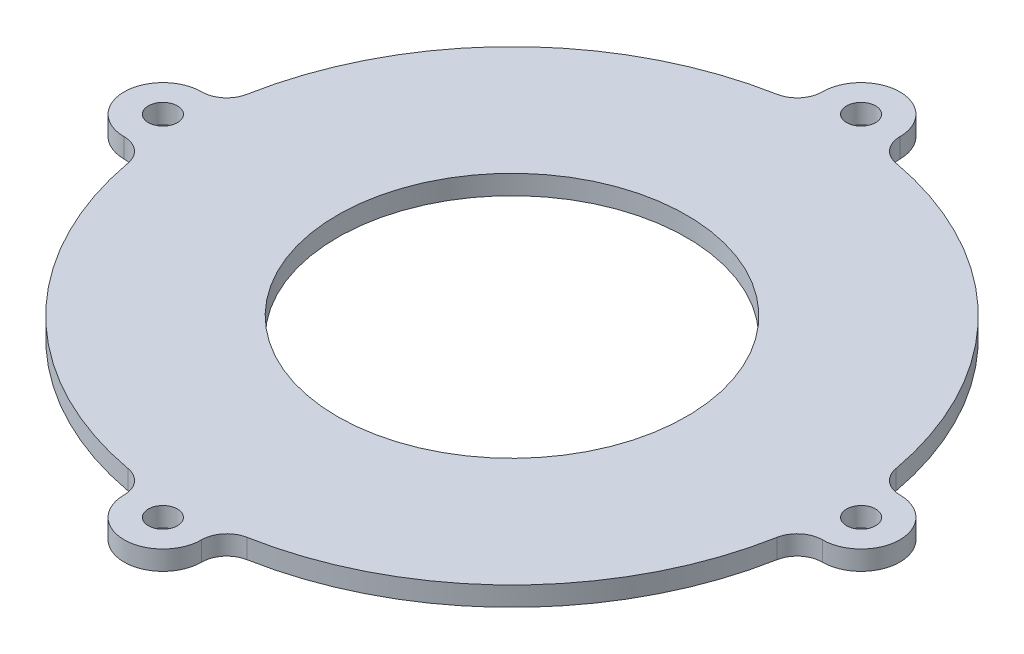
ISO-10303-21;
HEADER;
FILE_DESCRIPTION(('STEP AP214'),'2;1');
FILE_NAME('part.step','',(''),(''),'','','');
FILE_SCHEMA(('AUTOMOTIVE_DESIGN { 1 0 10303 214 1 1 1 1 }'));
ENDSEC;
DATA;
#1=APPLICATION_CONTEXT('core data for automotive mechanical design processes');
#2=APPLICATION_PROTOCOL_DEFINITION('international standard','automotive_design',2000,#1);
#3=PRODUCT_CONTEXT('',#1,'mechanical');
#4=PRODUCT('Part','Part','',(#3));
#5=PRODUCT_RELATED_PRODUCT_CATEGORY('part','',(#4));
#6=PRODUCT_DEFINITION_FORMATION('','',#4);
#7=PRODUCT_DEFINITION_CONTEXT('part definition',#1,'design');
#8=PRODUCT_DEFINITION('design','',#6,#7);
#9=PRODUCT_DEFINITION_SHAPE('','',#8);
#10=(LENGTH_UNIT() NAMED_UNIT(*) SI_UNIT(.MILLI.,.METRE.));
#11=(NAMED_UNIT(*) PLANE_ANGLE_UNIT() SI_UNIT($,.RADIAN.));
#12=(NAMED_UNIT(*) SI_UNIT($,.STERADIAN.) SOLID_ANGLE_UNIT());
#13=UNCERTAINTY_MEASURE_WITH_UNIT(LENGTH_MEASURE(1.E-05),#10,'distance_accuracy_value','');
#14=(GEOMETRIC_REPRESENTATION_CONTEXT(3) GLOBAL_UNCERTAINTY_ASSIGNED_CONTEXT((#13)) GLOBAL_UNIT_ASSIGNED_CONTEXT((#10,
#11,#12)) REPRESENTATION_CONTEXT('',''));
#15=CARTESIAN_POINT('',(0.,0.,0.));
#16=DIRECTION('',(0.,0.,1.));
#17=DIRECTION('',(1.,0.,0.));
#18=AXIS2_PLACEMENT_3D('',#15,#16,#17);
#19=CARTESIAN_POINT('',(0.,0.,0.));
#20=DIRECTION('',(0.,1.,0.));
#21=DIRECTION('',(0.,0.,1.));
#22=AXIS2_PLACEMENT_3D('',#19,#20,#21);
#23=PLANE('',#22);
#24=CARTESIAN_POINT('',(0.,0.,0.));
#25=DIRECTION('',(0.,1.,0.));
#26=DIRECTION('',(0.,0.,1.));
#27=AXIS2_PLACEMENT_3D('',#24,#25,#26);
#28=CIRCLE('',#27,18.);
#29=CARTESIAN_POINT('',(0.,0.,18.));
#30=VERTEX_POINT('',#29);
#31=EDGE_CURVE('E266',#30,#30,#28,.T.);
#32=ORIENTED_EDGE('',*,*,#31,.T.);
#33=EDGE_LOOP('',(#32));
#34=FACE_BOUND('',#33,.T.);
#35=CARTESIAN_POINT('',(0.,0.,0.));
#36=DIRECTION('',(0.,1.,0.));
#37=DIRECTION('',(0.,0.,1.));
#38=AXIS2_PLACEMENT_3D('',#35,#36,#37);
#39=CIRCLE('',#38,25.);
#40=CARTESIAN_POINT('',(0.,0.,25.));
#41=VERTEX_POINT('',#40);
#42=EDGE_CURVE('E11',#41,#41,#39,.T.);
#43=ORIENTED_EDGE('',*,*,#42,.F.);
#44=EDGE_LOOP('',(#43));
#45=FACE_BOUND('',#44,.T.);
#46=ADVANCED_FACE('F45',(#34,#45),#23,.F.);
#47=CARTESIAN_POINT('',(-36.,2.,-6.59999999999999));
#48=DIRECTION('',(0.,-1.,0.));
#49=DIRECTION('',(0.,0.,-1.));
#50=AXIS2_PLACEMENT_3D('',#47,#48,#49);
#51=CYLINDRICAL_SURFACE('',#50,2.59999999999999);
#52=CARTESIAN_POINT('',(-36.,0.,-6.59999999999999));
#53=DIRECTION('',(0.,1.,0.));
#54=DIRECTION('',(0.,0.,1.));
#55=AXIS2_PLACEMENT_3D('',#52,#53,#54);
#56=CIRCLE('',#55,2.59999999999999);
#57=CARTESIAN_POINT('',(-33.4426229508197,0.,-6.1311475409836));
#58=VERTEX_POINT('',#57);
#59=CARTESIAN_POINT('',(-36.,0.,-4.));
#60=VERTEX_POINT('',#59);
#61=EDGE_CURVE('E218',#58,#60,#56,.F.);
#62=ORIENTED_EDGE('',*,*,#61,.T.);
#63=DIRECTION('',(0.,-1.,0.));
#64=VECTOR('',#63,1.);
#65=CARTESIAN_POINT('',(-36.,2.,-4.));
#66=LINE('',#65,#64);
#67=CARTESIAN_POINT('',(-36.,2.,-4.));
#68=VERTEX_POINT('',#67);
#69=EDGE_CURVE('E55',#68,#60,#66,.T.);
#70=ORIENTED_EDGE('',*,*,#69,.F.);
#71=CARTESIAN_POINT('',(-36.,2.,-6.59999999999999));
#72=DIRECTION('',(0.,1.,0.));
#73=DIRECTION('',(0.,0.,1.));
#74=AXIS2_PLACEMENT_3D('',#71,#72,#73);
#75=CIRCLE('',#74,2.59999999999999);
#76=CARTESIAN_POINT('',(-33.4426229508197,2.,-6.1311475409836));
#77=VERTEX_POINT('',#76);
#78=EDGE_CURVE('E286',#77,#68,#75,.F.);
#79=ORIENTED_EDGE('',*,*,#78,.F.);
#80=DIRECTION('',(0.,-1.,0.));
#81=VECTOR('',#80,1.);
#82=CARTESIAN_POINT('',(-33.4426229508197,2.,-6.1311475409836));
#83=LINE('',#82,#81);
#84=EDGE_CURVE('E217',#77,#58,#83,.T.);
#85=ORIENTED_EDGE('',*,*,#84,.T.);
#86=EDGE_LOOP('',(#62,#70,#79,#85));
#87=FACE_BOUND('',#86,.T.);
#88=ADVANCED_FACE('F47',(#87),#51,.F.);
#89=CARTESIAN_POINT('',(-36.,2.,0.));
#90=DIRECTION('',(0.,-1.,0.));
#91=DIRECTION('',(0.,0.,-1.));
#92=AXIS2_PLACEMENT_3D('',#89,#90,#91);
#93=CYLINDRICAL_SURFACE('',#92,4.00000000000001);
#94=CARTESIAN_POINT('',(-36.,0.,0.));
#95=DIRECTION('',(0.,1.,0.));
#96=DIRECTION('',(0.,0.,1.));
#97=AXIS2_PLACEMENT_3D('',#94,#95,#96);
#98=CIRCLE('',#97,4.00000000000001);
#99=CARTESIAN_POINT('',(-36.,0.,4.00000000000002));
#100=VERTEX_POINT('',#99);
#101=EDGE_CURVE('E222',#60,#100,#98,.T.);
#102=ORIENTED_EDGE('',*,*,#101,.T.);
#103=DIRECTION('',(0.,-1.,0.));
#104=VECTOR('',#103,1.);
#105=CARTESIAN_POINT('',(-36.,2.,4.00000000000002));
#106=LINE('',#105,#104);
#107=CARTESIAN_POINT('',(-36.,2.,4.00000000000002));
#108=VERTEX_POINT('',#107);
#109=EDGE_CURVE('E328',#108,#100,#106,.T.);
#110=ORIENTED_EDGE('',*,*,#109,.F.);
#111=CARTESIAN_POINT('',(-36.,2.,0.));
#112=DIRECTION('',(0.,1.,0.));
#113=DIRECTION('',(0.,0.,1.));
#114=AXIS2_PLACEMENT_3D('',#111,#112,#113);
#115=CIRCLE('',#114,4.00000000000001);
#116=EDGE_CURVE('E127',#68,#108,#115,.T.);
#117=ORIENTED_EDGE('',*,*,#116,.F.);
#118=ORIENTED_EDGE('',*,*,#69,.T.);
#119=EDGE_LOOP('',(#102,#110,#117,#118));
#120=FACE_BOUND('',#119,.T.);
#121=ADVANCED_FACE('F332',(#120),#93,.T.);
#122=CARTESIAN_POINT('',(-36.,2.,6.6));
#123=DIRECTION('',(0.,-1.,0.));
#124=DIRECTION('',(0.,0.,-1.));
#125=AXIS2_PLACEMENT_3D('',#122,#123,#124);
#126=CYLINDRICAL_SURFACE('',#125,2.59999999999999);
#127=CARTESIAN_POINT('',(-36.,0.,6.6));
#128=DIRECTION('',(0.,1.,0.));
#129=DIRECTION('',(0.,0.,1.));
#130=AXIS2_PLACEMENT_3D('',#127,#128,#129);
#131=CIRCLE('',#130,2.59999999999999);
#132=CARTESIAN_POINT('',(-33.4426229508197,0.,6.13114754098361));
#133=VERTEX_POINT('',#132);
#134=EDGE_CURVE('E227',#133,#100,#131,.T.);
#135=ORIENTED_EDGE('',*,*,#134,.F.);
#136=DIRECTION('',(0.,-1.,0.));
#137=VECTOR('',#136,1.);
#138=CARTESIAN_POINT('',(-33.4426229508197,2.,6.13114754098361));
#139=LINE('',#138,#137);
#140=CARTESIAN_POINT('',(-33.4426229508197,2.,6.13114754098361));
#141=VERTEX_POINT('',#140);
#142=EDGE_CURVE('E325',#141,#133,#139,.T.);
#143=ORIENTED_EDGE('',*,*,#142,.F.);
#144=CARTESIAN_POINT('',(-36.,2.,6.6));
#145=DIRECTION('',(0.,1.,0.));
#146=DIRECTION('',(0.,0.,1.));
#147=AXIS2_PLACEMENT_3D('',#144,#145,#146);
#148=CIRCLE('',#147,2.59999999999999);
#149=EDGE_CURVE('E347',#141,#108,#148,.T.);
#150=ORIENTED_EDGE('',*,*,#149,.T.);
#151=ORIENTED_EDGE('',*,*,#109,.T.);
#152=EDGE_LOOP('',(#135,#143,#150,#151));
#153=FACE_BOUND('',#152,.T.);
#154=ADVANCED_FACE('F343',(#153),#126,.F.);
#155=CARTESIAN_POINT('',(0.,2.,0.));
#156=DIRECTION('',(0.,-1.,0.));
#157=DIRECTION('',(0.,0.,-1.));
#158=AXIS2_PLACEMENT_3D('',#155,#156,#157);
#159=CYLINDRICAL_SURFACE('',#158,34.);
#160=CARTESIAN_POINT('',(0.,0.,0.));
#161=DIRECTION('',(0.,1.,0.));
#162=DIRECTION('',(0.,0.,1.));
#163=AXIS2_PLACEMENT_3D('',#160,#161,#162);
#164=CIRCLE('',#163,34.);
#165=CARTESIAN_POINT('',(-6.1311475409836,0.,33.4426229508197));
#166=VERTEX_POINT('',#165);
#167=EDGE_CURVE('E231',#133,#166,#164,.T.);
#168=ORIENTED_EDGE('',*,*,#167,.T.);
#169=DIRECTION('',(0.,-1.,0.));
#170=VECTOR('',#169,1.);
#171=CARTESIAN_POINT('',(-6.1311475409836,2.,33.4426229508197));
#172=LINE('',#171,#170);
#173=CARTESIAN_POINT('',(-6.1311475409836,2.,33.4426229508197));
#174=VERTEX_POINT('',#173);
#175=EDGE_CURVE('E321',#174,#166,#172,.T.);
#176=ORIENTED_EDGE('',*,*,#175,.F.);
#177=CARTESIAN_POINT('',(0.,2.,0.));
#178=DIRECTION('',(0.,1.,0.));
#179=DIRECTION('',(0.,0.,1.));
#180=AXIS2_PLACEMENT_3D('',#177,#178,#179);
#181=CIRCLE('',#180,34.);
#182=EDGE_CURVE('E195',#141,#174,#181,.T.);
#183=ORIENTED_EDGE('',*,*,#182,.F.);
#184=ORIENTED_EDGE('',*,*,#142,.T.);
#185=EDGE_LOOP('',(#168,#176,#183,#184));
#186=FACE_BOUND('',#185,.T.);
#187=ADVANCED_FACE('F513',(#186),#159,.T.);
#188=CARTESIAN_POINT('',(-6.6,2.,36.));
#189=DIRECTION('',(0.,-1.,0.));
#190=DIRECTION('',(0.,0.,-1.));
#191=AXIS2_PLACEMENT_3D('',#188,#189,#190);
#192=CYLINDRICAL_SURFACE('',#191,2.59999999999999);
#193=CARTESIAN_POINT('',(-6.6,0.,36.));
#194=DIRECTION('',(0.,1.,0.));
#195=DIRECTION('',(0.,0.,1.));
#196=AXIS2_PLACEMENT_3D('',#193,#194,#195);
#197=CIRCLE('',#196,2.59999999999999);
#198=CARTESIAN_POINT('',(-4.,0.,36.));
#199=VERTEX_POINT('',#198);
#200=EDGE_CURVE('E234',#166,#199,#197,.F.);
#201=ORIENTED_EDGE('',*,*,#200,.T.);
#202=DIRECTION('',(0.,-1.,0.));
#203=VECTOR('',#202,1.);
#204=CARTESIAN_POINT('',(-4.,2.,36.));
#205=LINE('',#204,#203);
#206=CARTESIAN_POINT('',(-4.,2.,36.));
#207=VERTEX_POINT('',#206);
#208=EDGE_CURVE('E317',#207,#199,#205,.T.);
#209=ORIENTED_EDGE('',*,*,#208,.F.);
#210=CARTESIAN_POINT('',(-6.6,2.,36.));
#211=DIRECTION('',(0.,1.,0.));
#212=DIRECTION('',(0.,0.,1.));
#213=AXIS2_PLACEMENT_3D('',#210,#211,#212);
#214=CIRCLE('',#213,2.59999999999999);
#215=EDGE_CURVE('E352',#174,#207,#214,.F.);
#216=ORIENTED_EDGE('',*,*,#215,.F.);
#217=ORIENTED_EDGE('',*,*,#175,.T.);
#218=EDGE_LOOP('',(#201,#209,#216,#217));
#219=FACE_BOUND('',#218,.T.);
#220=ADVANCED_FACE('F647',(#219),#192,.F.);
#221=CARTESIAN_POINT('',(0.,2.,36.));
#222=DIRECTION('',(0.,-1.,0.));
#223=DIRECTION('',(0.,0.,-1.));
#224=AXIS2_PLACEMENT_3D('',#221,#222,#223);
#225=CYLINDRICAL_SURFACE('',#224,3.99999999999999);
#226=CARTESIAN_POINT('',(0.,0.,36.));
#227=DIRECTION('',(0.,1.,0.));
#228=DIRECTION('',(0.,0.,1.));
#229=AXIS2_PLACEMENT_3D('',#226,#227,#228);
#230=CIRCLE('',#229,3.99999999999999);
#231=CARTESIAN_POINT('',(4.,0.,36.));
#232=VERTEX_POINT('',#231);
#233=EDGE_CURVE('E238',#199,#232,#230,.T.);
#234=ORIENTED_EDGE('',*,*,#233,.T.);
#235=DIRECTION('',(0.,-1.,0.));
#236=VECTOR('',#235,1.);
#237=CARTESIAN_POINT('',(4.,2.,36.));
#238=LINE('',#237,#236);
#239=CARTESIAN_POINT('',(4.,2.,36.));
#240=VERTEX_POINT('',#239);
#241=EDGE_CURVE('E314',#240,#232,#238,.T.);
#242=ORIENTED_EDGE('',*,*,#241,.F.);
#243=CARTESIAN_POINT('',(0.,2.,36.));
#244=DIRECTION('',(0.,1.,0.));
#245=DIRECTION('',(0.,0.,1.));
#246=AXIS2_PLACEMENT_3D('',#243,#244,#245);
#247=CIRCLE('',#246,3.99999999999999);
#248=EDGE_CURVE('E359',#207,#240,#247,.T.);
#249=ORIENTED_EDGE('',*,*,#248,.F.);
#250=ORIENTED_EDGE('',*,*,#208,.T.);
#251=EDGE_LOOP('',(#234,#242,#249,#250));
#252=FACE_BOUND('',#251,.T.);
#253=ADVANCED_FACE('F636',(#252),#225,.T.);
#254=CARTESIAN_POINT('',(6.6,2.,36.));
#255=DIRECTION('',(0.,-1.,0.));
#256=DIRECTION('',(0.,0.,-1.));
#257=AXIS2_PLACEMENT_3D('',#254,#255,#256);
#258=CYLINDRICAL_SURFACE('',#257,2.59999999999999);
#259=CARTESIAN_POINT('',(6.6,0.,36.));
#260=DIRECTION('',(0.,1.,0.));
#261=DIRECTION('',(0.,0.,1.));
#262=AXIS2_PLACEMENT_3D('',#259,#260,#261);
#263=CIRCLE('',#262,2.59999999999999);
#264=CARTESIAN_POINT('',(6.13114754098361,0.,33.4426229508197));
#265=VERTEX_POINT('',#264);
#266=EDGE_CURVE('E242',#265,#232,#263,.T.);
#267=ORIENTED_EDGE('',*,*,#266,.F.);
#268=DIRECTION('',(0.,-1.,0.));
#269=VECTOR('',#268,1.);
#270=CARTESIAN_POINT('',(6.13114754098361,2.,33.4426229508197));
#271=LINE('',#270,#269);
#272=CARTESIAN_POINT('',(6.13114754098361,2.,33.4426229508197));
#273=VERTEX_POINT('',#272);
#274=EDGE_CURVE('E311',#273,#265,#271,.T.);
#275=ORIENTED_EDGE('',*,*,#274,.F.);
#276=CARTESIAN_POINT('',(6.6,2.,36.));
#277=DIRECTION('',(0.,1.,0.));
#278=DIRECTION('',(0.,0.,1.));
#279=AXIS2_PLACEMENT_3D('',#276,#277,#278);
#280=CIRCLE('',#279,2.59999999999999);
#281=EDGE_CURVE('E362',#273,#240,#280,.T.);
#282=ORIENTED_EDGE('',*,*,#281,.T.);
#283=ORIENTED_EDGE('',*,*,#241,.T.);
#284=EDGE_LOOP('',(#267,#275,#282,#283));
#285=FACE_BOUND('',#284,.T.);
#286=ADVANCED_FACE('F627',(#285),#258,.F.);
#287=CARTESIAN_POINT('',(33.4426229508197,0.,6.13114754098361));
#288=VERTEX_POINT('',#287);
#289=EDGE_CURVE('E235',#265,#288,#164,.T.);
#290=ORIENTED_EDGE('',*,*,#289,.T.);
#291=DIRECTION('',(0.,-1.,0.));
#292=VECTOR('',#291,1.);
#293=CARTESIAN_POINT('',(33.4426229508197,2.,6.13114754098361));
#294=LINE('',#293,#292);
#295=CARTESIAN_POINT('',(33.4426229508197,2.,6.13114754098361));
#296=VERTEX_POINT('',#295);
#297=EDGE_CURVE('E307',#296,#288,#294,.T.);
#298=ORIENTED_EDGE('',*,*,#297,.F.);
#299=EDGE_CURVE('E353',#273,#296,#181,.T.);
#300=ORIENTED_EDGE('',*,*,#299,.F.);
#301=ORIENTED_EDGE('',*,*,#274,.T.);
#302=EDGE_LOOP('',(#290,#298,#300,#301));
#303=FACE_BOUND('',#302,.T.);
#304=ADVANCED_FACE('F387',(#303),#159,.T.);
#305=CARTESIAN_POINT('',(36.,2.,6.6));
#306=DIRECTION('',(0.,-1.,0.));
#307=DIRECTION('',(0.,0.,-1.));
#308=AXIS2_PLACEMENT_3D('',#305,#306,#307);
#309=CYLINDRICAL_SURFACE('',#308,2.59999999999999);
#310=CARTESIAN_POINT('',(36.,0.,6.6));
#311=DIRECTION('',(0.,1.,0.));
#312=DIRECTION('',(0.,0.,1.));
#313=AXIS2_PLACEMENT_3D('',#310,#311,#312);
#314=CIRCLE('',#313,2.59999999999999);
#315=CARTESIAN_POINT('',(36.,0.,4.00000000000001));
#316=VERTEX_POINT('',#315);
#317=EDGE_CURVE('E246',#288,#316,#314,.F.);
#318=ORIENTED_EDGE('',*,*,#317,.T.);
#319=DIRECTION('',(0.,-1.,0.));
#320=VECTOR('',#319,1.);
#321=CARTESIAN_POINT('',(36.,2.,4.00000000000001));
#322=LINE('',#321,#320);
#323=CARTESIAN_POINT('',(36.,2.,4.00000000000001));
#324=VERTEX_POINT('',#323);
#325=EDGE_CURVE('E303',#324,#316,#322,.T.);
#326=ORIENTED_EDGE('',*,*,#325,.F.);
#327=CARTESIAN_POINT('',(36.,2.,6.6));
#328=DIRECTION('',(0.,1.,0.));
#329=DIRECTION('',(0.,0.,1.));
#330=AXIS2_PLACEMENT_3D('',#327,#328,#329);
#331=CIRCLE('',#330,2.59999999999999);
#332=EDGE_CURVE('E366',#296,#324,#331,.F.);
#333=ORIENTED_EDGE('',*,*,#332,.F.);
#334=ORIENTED_EDGE('',*,*,#297,.T.);
#335=EDGE_LOOP('',(#318,#326,#333,#334));
#336=FACE_BOUND('',#335,.T.);
#337=ADVANCED_FACE('F391',(#336),#309,.F.);
#338=CARTESIAN_POINT('',(36.,2.,0.));
#339=DIRECTION('',(0.,-1.,0.));
#340=DIRECTION('',(0.,0.,-1.));
#341=AXIS2_PLACEMENT_3D('',#338,#339,#340);
#342=CYLINDRICAL_SURFACE('',#341,4.);
#343=CARTESIAN_POINT('',(36.,0.,0.));
#344=DIRECTION('',(0.,1.,0.));
#345=DIRECTION('',(0.,0.,1.));
#346=AXIS2_PLACEMENT_3D('',#343,#344,#345);
#347=CIRCLE('',#346,4.);
#348=CARTESIAN_POINT('',(36.,0.,-4.00000000000001));
#349=VERTEX_POINT('',#348);
#350=EDGE_CURVE('E249',#316,#349,#347,.T.);
#351=ORIENTED_EDGE('',*,*,#350,.T.);
#352=DIRECTION('',(0.,-1.,0.));
#353=VECTOR('',#352,1.);
#354=CARTESIAN_POINT('',(36.,2.,-4.00000000000001));
#355=LINE('',#354,#353);
#356=CARTESIAN_POINT('',(36.,2.,-4.00000000000001));
#357=VERTEX_POINT('',#356);
#358=EDGE_CURVE('E300',#357,#349,#355,.T.);
#359=ORIENTED_EDGE('',*,*,#358,.F.);
#360=CARTESIAN_POINT('',(36.,2.,0.));
#361=DIRECTION('',(0.,1.,0.));
#362=DIRECTION('',(0.,0.,1.));
#363=AXIS2_PLACEMENT_3D('',#360,#361,#362);
#364=CIRCLE('',#363,4.);
#365=EDGE_CURVE('E369',#324,#357,#364,.T.);
#366=ORIENTED_EDGE('',*,*,#365,.F.);
#367=ORIENTED_EDGE('',*,*,#325,.T.);
#368=EDGE_LOOP('',(#351,#359,#366,#367));
#369=FACE_BOUND('',#368,.T.);
#370=ADVANCED_FACE('F396',(#369),#342,.T.);
#371=CARTESIAN_POINT('',(36.,2.,-6.6));
#372=DIRECTION('',(0.,-1.,0.));
#373=DIRECTION('',(0.,0.,-1.));
#374=AXIS2_PLACEMENT_3D('',#371,#372,#373);
#375=CYLINDRICAL_SURFACE('',#374,2.59999999999999);
#376=CARTESIAN_POINT('',(36.,0.,-6.6));
#377=DIRECTION('',(0.,1.,0.));
#378=DIRECTION('',(0.,0.,1.));
#379=AXIS2_PLACEMENT_3D('',#376,#377,#378);
#380=CIRCLE('',#379,2.59999999999999);
#381=CARTESIAN_POINT('',(33.4426229508197,0.,-6.13114754098361));
#382=VERTEX_POINT('',#381);
#383=EDGE_CURVE('E253',#382,#349,#380,.T.);
#384=ORIENTED_EDGE('',*,*,#383,.F.);
#385=DIRECTION('',(0.,-1.,0.));
#386=VECTOR('',#385,1.);
#387=CARTESIAN_POINT('',(33.4426229508197,2.,-6.13114754098361));
#388=LINE('',#387,#386);
#389=CARTESIAN_POINT('',(33.4426229508197,2.,-6.13114754098361));
#390=VERTEX_POINT('',#389);
#391=EDGE_CURVE('E297',#390,#382,#388,.T.);
#392=ORIENTED_EDGE('',*,*,#391,.F.);
#393=CARTESIAN_POINT('',(36.,2.,-6.6));
#394=DIRECTION('',(0.,1.,0.));
#395=DIRECTION('',(0.,0.,1.));
#396=AXIS2_PLACEMENT_3D('',#393,#394,#395);
#397=CIRCLE('',#396,2.59999999999999);
#398=EDGE_CURVE('E372',#390,#357,#397,.T.);
#399=ORIENTED_EDGE('',*,*,#398,.T.);
#400=ORIENTED_EDGE('',*,*,#358,.T.);
#401=EDGE_LOOP('',(#384,#392,#399,#400));
#402=FACE_BOUND('',#401,.T.);
#403=ADVANCED_FACE('F399',(#402),#375,.F.);
#404=CARTESIAN_POINT('',(6.1311475409836,0.,-33.4426229508197));
#405=VERTEX_POINT('',#404);
#406=EDGE_CURVE('E257',#382,#405,#164,.T.);
#407=ORIENTED_EDGE('',*,*,#406,.T.);
#408=DIRECTION('',(0.,-1.,0.));
#409=VECTOR('',#408,1.);
#410=CARTESIAN_POINT('',(6.1311475409836,2.,-33.4426229508197));
#411=LINE('',#410,#409);
#412=CARTESIAN_POINT('',(6.1311475409836,2.,-33.4426229508197));
#413=VERTEX_POINT('',#412);
#414=EDGE_CURVE('E293',#413,#405,#411,.T.);
#415=ORIENTED_EDGE('',*,*,#414,.F.);
#416=EDGE_CURVE('E194',#390,#413,#181,.T.);
#417=ORIENTED_EDGE('',*,*,#416,.F.);
#418=ORIENTED_EDGE('',*,*,#391,.T.);
#419=EDGE_LOOP('',(#407,#415,#417,#418));
#420=FACE_BOUND('',#419,.T.);
#421=ADVANCED_FACE('F402',(#420),#159,.T.);
#422=CARTESIAN_POINT('',(6.59999999999999,2.,-36.));
#423=DIRECTION('',(0.,-1.,0.));
#424=DIRECTION('',(0.,0.,-1.));
#425=AXIS2_PLACEMENT_3D('',#422,#423,#424);
#426=CYLINDRICAL_SURFACE('',#425,2.59999999999999);
#427=CARTESIAN_POINT('',(6.59999999999999,0.,-36.));
#428=DIRECTION('',(0.,1.,0.));
#429=DIRECTION('',(0.,0.,1.));
#430=AXIS2_PLACEMENT_3D('',#427,#428,#429);
#431=CIRCLE('',#430,2.59999999999999);
#432=CARTESIAN_POINT('',(4.,0.,-36.));
#433=VERTEX_POINT('',#432);
#434=EDGE_CURVE('E258',#405,#433,#431,.F.);
#435=ORIENTED_EDGE('',*,*,#434,.T.);
#436=DIRECTION('',(0.,-1.,0.));
#437=VECTOR('',#436,1.);
#438=CARTESIAN_POINT('',(4.,2.,-36.));
#439=LINE('',#438,#437);
#440=CARTESIAN_POINT('',(4.,2.,-36.));
#441=VERTEX_POINT('',#440);
#442=EDGE_CURVE('E186',#441,#433,#439,.T.);
#443=ORIENTED_EDGE('',*,*,#442,.F.);
#444=CARTESIAN_POINT('',(6.59999999999999,2.,-36.));
#445=DIRECTION('',(0.,1.,0.));
#446=DIRECTION('',(0.,0.,1.));
#447=AXIS2_PLACEMENT_3D('',#444,#445,#446);
#448=CIRCLE('',#447,2.59999999999999);
#449=EDGE_CURVE('E171',#413,#441,#448,.F.);
#450=ORIENTED_EDGE('',*,*,#449,.F.);
#451=ORIENTED_EDGE('',*,*,#414,.T.);
#452=EDGE_LOOP('',(#435,#443,#450,#451));
#453=FACE_BOUND('',#452,.T.);
#454=ADVANCED_FACE('F405',(#453),#426,.F.);
#455=CARTESIAN_POINT('',(0.,2.,-36.));
#456=DIRECTION('',(0.,-1.,0.));
#457=DIRECTION('',(0.,0.,-1.));
#458=AXIS2_PLACEMENT_3D('',#455,#456,#457);
#459=CYLINDRICAL_SURFACE('',#458,3.99999999999999);
#460=CARTESIAN_POINT('',(0.,0.,-36.));
#461=DIRECTION('',(0.,1.,0.));
#462=DIRECTION('',(0.,0.,1.));
#463=AXIS2_PLACEMENT_3D('',#460,#461,#462);
#464=CIRCLE('',#463,3.99999999999999);
#465=CARTESIAN_POINT('',(-4.,0.,-36.));
#466=VERTEX_POINT('',#465);
#467=EDGE_CURVE('E181',#433,#466,#464,.T.);
#468=ORIENTED_EDGE('',*,*,#467,.T.);
#469=DIRECTION('',(0.,-1.,0.));
#470=VECTOR('',#469,1.);
#471=CARTESIAN_POINT('',(-4.,2.,-36.));
#472=LINE('',#471,#470);
#473=CARTESIAN_POINT('',(-4.,2.,-36.));
#474=VERTEX_POINT('',#473);
#475=EDGE_CURVE('E178',#474,#466,#472,.T.);
#476=ORIENTED_EDGE('',*,*,#475,.F.);
#477=CARTESIAN_POINT('',(0.,2.,-36.));
#478=DIRECTION('',(0.,1.,0.));
#479=DIRECTION('',(0.,0.,1.));
#480=AXIS2_PLACEMENT_3D('',#477,#478,#479);
#481=CIRCLE('',#480,3.99999999999999);
#482=EDGE_CURVE('E164',#441,#474,#481,.T.);
#483=ORIENTED_EDGE('',*,*,#482,.F.);
#484=ORIENTED_EDGE('',*,*,#442,.T.);
#485=EDGE_LOOP('',(#468,#476,#483,#484));
#486=FACE_BOUND('',#485,.T.);
#487=ADVANCED_FACE('F179',(#486),#459,.T.);
#488=CARTESIAN_POINT('',(-6.60000000000001,2.,-36.));
#489=DIRECTION('',(0.,-1.,0.));
#490=DIRECTION('',(0.,0.,-1.));
#491=AXIS2_PLACEMENT_3D('',#488,#489,#490);
#492=CYLINDRICAL_SURFACE('',#491,2.59999999999999);
#493=CARTESIAN_POINT('',(-6.60000000000001,0.,-36.));
#494=DIRECTION('',(0.,1.,0.));
#495=DIRECTION('',(0.,0.,1.));
#496=AXIS2_PLACEMENT_3D('',#493,#494,#495);
#497=CIRCLE('',#496,2.59999999999999);
#498=CARTESIAN_POINT('',(-6.13114754098361,0.,-33.4426229508197));
#499=VERTEX_POINT('',#498);
#500=EDGE_CURVE('E263',#499,#466,#497,.T.);
#501=ORIENTED_EDGE('',*,*,#500,.F.);
#502=DIRECTION('',(0.,-1.,0.));
#503=VECTOR('',#502,1.);
#504=CARTESIAN_POINT('',(-6.13114754098361,2.,-33.4426229508197));
#505=LINE('',#504,#503);
#506=CARTESIAN_POINT('',(-6.13114754098361,2.,-33.4426229508197));
#507=VERTEX_POINT('',#506);
#508=EDGE_CURVE('E115',#507,#499,#505,.T.);
#509=ORIENTED_EDGE('',*,*,#508,.F.);
#510=CARTESIAN_POINT('',(-6.60000000000001,2.,-36.));
#511=DIRECTION('',(0.,1.,0.));
#512=DIRECTION('',(0.,0.,1.));
#513=AXIS2_PLACEMENT_3D('',#510,#511,#512);
#514=CIRCLE('',#513,2.59999999999999);
#515=EDGE_CURVE('E169',#507,#474,#514,.T.);
#516=ORIENTED_EDGE('',*,*,#515,.T.);
#517=ORIENTED_EDGE('',*,*,#475,.T.);
#518=EDGE_LOOP('',(#501,#509,#516,#517));
#519=FACE_BOUND('',#518,.T.);
#520=ADVANCED_FACE('F188',(#519),#492,.F.);
#521=CARTESIAN_POINT('',(36.,2.,0.));
#522=DIRECTION('',(0.,-1.,0.));
#523=DIRECTION('',(0.,0.,-1.));
#524=AXIS2_PLACEMENT_3D('',#521,#522,#523);
#525=CYLINDRICAL_SURFACE('',#524,1.5);
#526=CARTESIAN_POINT('',(36.,2.,0.));
#527=DIRECTION('',(0.,1.,0.));
#528=DIRECTION('',(0.,0.,1.));
#529=AXIS2_PLACEMENT_3D('',#526,#527,#528);
#530=CIRCLE('',#529,1.5);
#531=CARTESIAN_POINT('',(36.,2.,1.5));
#532=VERTEX_POINT('',#531);
#533=EDGE_CURVE('E209',#532,#532,#530,.T.);
#534=ORIENTED_EDGE('',*,*,#533,.T.);
#535=EDGE_LOOP('',(#534));
#536=FACE_BOUND('',#535,.T.);
#537=CARTESIAN_POINT('',(36.,0.,0.));
#538=DIRECTION('',(0.,1.,0.));
#539=DIRECTION('',(0.,0.,1.));
#540=AXIS2_PLACEMENT_3D('',#537,#538,#539);
#541=CIRCLE('',#540,1.5);
#542=CARTESIAN_POINT('',(36.,0.,1.5));
#543=VERTEX_POINT('',#542);
#544=EDGE_CURVE('E278',#543,#543,#541,.T.);
#545=ORIENTED_EDGE('',*,*,#544,.F.);
#546=EDGE_LOOP('',(#545));
#547=FACE_BOUND('',#546,.T.);
#548=ADVANCED_FACE('F544',(#536,#547),#525,.F.);
#549=CARTESIAN_POINT('',(0.,2.,-36.));
#550=DIRECTION('',(0.,-1.,0.));
#551=DIRECTION('',(0.,0.,-1.));
#552=AXIS2_PLACEMENT_3D('',#549,#550,#551);
#553=CYLINDRICAL_SURFACE('',#552,1.5);
#554=CARTESIAN_POINT('',(0.,2.,-36.));
#555=DIRECTION('',(0.,1.,0.));
#556=DIRECTION('',(0.,0.,1.));
#557=AXIS2_PLACEMENT_3D('',#554,#555,#556);
#558=CIRCLE('',#557,1.5);
#559=CARTESIAN_POINT('',(0.,2.,-34.5));
#560=VERTEX_POINT('',#559);
#561=EDGE_CURVE('E205',#560,#560,#558,.T.);
#562=ORIENTED_EDGE('',*,*,#561,.T.);
#563=EDGE_LOOP('',(#562));
#564=FACE_BOUND('',#563,.T.);
#565=CARTESIAN_POINT('',(0.,0.,-36.));
#566=DIRECTION('',(0.,1.,0.));
#567=DIRECTION('',(0.,0.,1.));
#568=AXIS2_PLACEMENT_3D('',#565,#566,#567);
#569=CIRCLE('',#568,1.5);
#570=CARTESIAN_POINT('',(0.,0.,-34.5));
#571=VERTEX_POINT('',#570);
#572=EDGE_CURVE('E274',#571,#571,#569,.T.);
#573=ORIENTED_EDGE('',*,*,#572,.F.);
#574=EDGE_LOOP('',(#573));
#575=FACE_BOUND('',#574,.T.);
#576=ADVANCED_FACE('F533',(#564,#575),#553,.F.);
#577=CARTESIAN_POINT('',(-36.,2.,0.));
#578=DIRECTION('',(0.,-1.,0.));
#579=DIRECTION('',(0.,0.,-1.));
#580=AXIS2_PLACEMENT_3D('',#577,#578,#579);
#581=CYLINDRICAL_SURFACE('',#580,1.50000000000001);
#582=CARTESIAN_POINT('',(-36.,2.,0.));
#583=DIRECTION('',(0.,1.,0.));
#584=DIRECTION('',(0.,0.,1.));
#585=AXIS2_PLACEMENT_3D('',#582,#583,#584);
#586=CIRCLE('',#585,1.50000000000001);
#587=CARTESIAN_POINT('',(-36.,2.,1.50000000000002));
#588=VERTEX_POINT('',#587);
#589=EDGE_CURVE('E201',#588,#588,#586,.T.);
#590=ORIENTED_EDGE('',*,*,#589,.T.);
#591=EDGE_LOOP('',(#590));
#592=FACE_BOUND('',#591,.T.);
#593=CARTESIAN_POINT('',(-36.,0.,0.));
#594=DIRECTION('',(0.,1.,0.));
#595=DIRECTION('',(0.,0.,1.));
#596=AXIS2_PLACEMENT_3D('',#593,#594,#595);
#597=CIRCLE('',#596,1.50000000000001);
#598=CARTESIAN_POINT('',(-36.,0.,1.50000000000002));
#599=VERTEX_POINT('',#598);
#600=EDGE_CURVE('E270',#599,#599,#597,.T.);
#601=ORIENTED_EDGE('',*,*,#600,.F.);
#602=EDGE_LOOP('',(#601));
#603=FACE_BOUND('',#602,.T.);
#604=ADVANCED_FACE('F522',(#592,#603),#581,.F.);
#605=CARTESIAN_POINT('',(0.,2.,0.));
#606=DIRECTION('',(0.,-1.,0.));
#607=DIRECTION('',(0.,0.,-1.));
#608=AXIS2_PLACEMENT_3D('',#605,#606,#607);
#609=CYLINDRICAL_SURFACE('',#608,18.);
#610=CARTESIAN_POINT('',(0.,2.,0.));
#611=DIRECTION('',(0.,1.,0.));
#612=DIRECTION('',(0.,0.,1.));
#613=AXIS2_PLACEMENT_3D('',#610,#611,#612);
#614=CIRCLE('',#613,18.);
#615=CARTESIAN_POINT('',(0.,2.,18.));
#616=VERTEX_POINT('',#615);
#617=EDGE_CURVE('E192',#616,#616,#614,.T.);
#618=ORIENTED_EDGE('',*,*,#617,.T.);
#619=EDGE_LOOP('',(#618));
#620=FACE_BOUND('',#619,.T.);
#621=ORIENTED_EDGE('',*,*,#31,.F.);
#622=EDGE_LOOP('',(#621));
#623=FACE_BOUND('',#622,.T.);
#624=ADVANCED_FACE('F511',(#620,#623),#609,.F.);
#625=EDGE_CURVE('E118',#499,#58,#164,.T.);
#626=ORIENTED_EDGE('',*,*,#625,.T.);
#627=ORIENTED_EDGE('',*,*,#84,.F.);
#628=EDGE_CURVE('E63',#507,#77,#181,.T.);
#629=ORIENTED_EDGE('',*,*,#628,.F.);
#630=ORIENTED_EDGE('',*,*,#508,.T.);
#631=EDGE_LOOP('',(#626,#627,#629,#630));
#632=FACE_BOUND('',#631,.T.);
#633=ADVANCED_FACE('F500',(#632),#159,.T.);
#634=CARTESIAN_POINT('',(0.,2.,36.));
#635=DIRECTION('',(0.,-1.,0.));
#636=DIRECTION('',(0.,0.,-1.));
#637=AXIS2_PLACEMENT_3D('',#634,#635,#636);
#638=CYLINDRICAL_SURFACE('',#637,1.5);
#639=CARTESIAN_POINT('',(0.,2.,36.));
#640=DIRECTION('',(0.,1.,0.));
#641=DIRECTION('',(0.,0.,1.));
#642=AXIS2_PLACEMENT_3D('',#639,#640,#641);
#643=CIRCLE('',#642,1.5);
#644=CARTESIAN_POINT('',(0.,2.,37.5));
#645=VERTEX_POINT('',#644);
#646=EDGE_CURVE('E213',#645,#645,#643,.T.);
#647=ORIENTED_EDGE('',*,*,#646,.T.);
#648=EDGE_LOOP('',(#647));
#649=FACE_BOUND('',#648,.T.);
#650=CARTESIAN_POINT('',(0.,0.,36.));
#651=DIRECTION('',(0.,1.,0.));
#652=DIRECTION('',(0.,0.,1.));
#653=AXIS2_PLACEMENT_3D('',#650,#651,#652);
#654=CIRCLE('',#653,1.5);
#655=CARTESIAN_POINT('',(0.,0.,37.5));
#656=VERTEX_POINT('',#655);
#657=EDGE_CURVE('E282',#656,#656,#654,.T.);
#658=ORIENTED_EDGE('',*,*,#657,.F.);
#659=EDGE_LOOP('',(#658));
#660=FACE_BOUND('',#659,.T.);
#661=ADVANCED_FACE('F446',(#649,#660),#638,.F.);
#662=CARTESIAN_POINT('',(0.,2.,0.));
#663=DIRECTION('',(0.,1.,0.));
#664=DIRECTION('',(0.,0.,1.));
#665=AXIS2_PLACEMENT_3D('',#662,#663,#664);
#666=PLANE('',#665);
#667=ORIENTED_EDGE('',*,*,#78,.T.);
#668=ORIENTED_EDGE('',*,*,#116,.T.);
#669=ORIENTED_EDGE('',*,*,#149,.F.);
#670=ORIENTED_EDGE('',*,*,#182,.T.);
#671=ORIENTED_EDGE('',*,*,#215,.T.);
#672=ORIENTED_EDGE('',*,*,#248,.T.);
#673=ORIENTED_EDGE('',*,*,#281,.F.);
#674=ORIENTED_EDGE('',*,*,#299,.T.);
#675=ORIENTED_EDGE('',*,*,#332,.T.);
#676=ORIENTED_EDGE('',*,*,#365,.T.);
#677=ORIENTED_EDGE('',*,*,#398,.F.);
#678=ORIENTED_EDGE('',*,*,#416,.T.);
#679=ORIENTED_EDGE('',*,*,#449,.T.);
#680=ORIENTED_EDGE('',*,*,#482,.T.);
#681=ORIENTED_EDGE('',*,*,#515,.F.);
#682=ORIENTED_EDGE('',*,*,#628,.T.);
#683=EDGE_LOOP('',(#667,#668,#669,#670,#671,#672,#673,#674,#675,#676,#677,#678,#679,#680,#681,#682));
#684=FACE_BOUND('',#683,.T.);
#685=ORIENTED_EDGE('',*,*,#617,.F.);
#686=EDGE_LOOP('',(#685));
#687=FACE_BOUND('',#686,.T.);
#688=ORIENTED_EDGE('',*,*,#589,.F.);
#689=EDGE_LOOP('',(#688));
#690=FACE_BOUND('',#689,.T.);
#691=ORIENTED_EDGE('',*,*,#561,.F.);
#692=EDGE_LOOP('',(#691));
#693=FACE_BOUND('',#692,.T.);
#694=ORIENTED_EDGE('',*,*,#533,.F.);
#695=EDGE_LOOP('',(#694));
#696=FACE_BOUND('',#695,.T.);
#697=ORIENTED_EDGE('',*,*,#646,.F.);
#698=EDGE_LOOP('',(#697));
#699=FACE_BOUND('',#698,.T.);
#700=ADVANCED_FACE('F166',(#684,#687,#690,#693,#696,#699),#666,.T.);
#701=CARTESIAN_POINT('',(0.,0.,0.));
#702=DIRECTION('',(0.,1.,0.));
#703=DIRECTION('',(0.,0.,1.));
#704=AXIS2_PLACEMENT_3D('',#701,#702,#703);
#705=CIRCLE('',#704,31.);
#706=CARTESIAN_POINT('',(0.,0.,31.));
#707=VERTEX_POINT('',#706);
#708=EDGE_CURVE('E411',#707,#707,#705,.T.);
#709=ORIENTED_EDGE('',*,*,#708,.T.);
#710=EDGE_LOOP('',(#709));
#711=FACE_BOUND('',#710,.T.);
#712=ORIENTED_EDGE('',*,*,#61,.F.);
#713=ORIENTED_EDGE('',*,*,#625,.F.);
#714=ORIENTED_EDGE('',*,*,#500,.T.);
#715=ORIENTED_EDGE('',*,*,#467,.F.);
#716=ORIENTED_EDGE('',*,*,#434,.F.);
#717=ORIENTED_EDGE('',*,*,#406,.F.);
#718=ORIENTED_EDGE('',*,*,#383,.T.);
#719=ORIENTED_EDGE('',*,*,#350,.F.);
#720=ORIENTED_EDGE('',*,*,#317,.F.);
#721=ORIENTED_EDGE('',*,*,#289,.F.);
#722=ORIENTED_EDGE('',*,*,#266,.T.);
#723=ORIENTED_EDGE('',*,*,#233,.F.);
#724=ORIENTED_EDGE('',*,*,#200,.F.);
#725=ORIENTED_EDGE('',*,*,#167,.F.);
#726=ORIENTED_EDGE('',*,*,#134,.T.);
#727=ORIENTED_EDGE('',*,*,#101,.F.);
#728=EDGE_LOOP('',(#712,#713,#714,#715,#716,#717,#718,#719,#720,#721,#722,#723,#724,#725,#726,#727));
#729=FACE_BOUND('',#728,.T.);
#730=ORIENTED_EDGE('',*,*,#600,.T.);
#731=EDGE_LOOP('',(#730));
#732=FACE_BOUND('',#731,.T.);
#733=ORIENTED_EDGE('',*,*,#572,.T.);
#734=EDGE_LOOP('',(#733));
#735=FACE_BOUND('',#734,.T.);
#736=ORIENTED_EDGE('',*,*,#544,.T.);
#737=EDGE_LOOP('',(#736));
#738=FACE_BOUND('',#737,.T.);
#739=ORIENTED_EDGE('',*,*,#657,.T.);
#740=EDGE_LOOP('',(#739));
#741=FACE_BOUND('',#740,.T.);
#742=ADVANCED_FACE('F337',(#711,#729,#732,#735,#738,#741),#23,.F.);
#743=CARTESIAN_POINT('',(0.,-1.,0.));
#744=DIRECTION('',(0.,1.,0.));
#745=DIRECTION('',(0.,0.,1.));
#746=AXIS2_PLACEMENT_3D('',#743,#744,#745);
#747=CYLINDRICAL_SURFACE('',#746,25.);
#748=CARTESIAN_POINT('',(0.,-1.,0.));
#749=DIRECTION('',(0.,1.,0.));
#750=DIRECTION('',(0.,0.,1.));
#751=AXIS2_PLACEMENT_3D('',#748,#749,#750);
#752=CIRCLE('',#751,25.);
#753=CARTESIAN_POINT('',(0.,-1.,25.));
#754=VERTEX_POINT('',#753);
#755=EDGE_CURVE('E415',#754,#754,#752,.T.);
#756=ORIENTED_EDGE('',*,*,#755,.F.);
#757=EDGE_LOOP('',(#756));
#758=FACE_BOUND('',#757,.T.);
#759=ORIENTED_EDGE('',*,*,#42,.T.);
#760=EDGE_LOOP('',(#759));
#761=FACE_BOUND('',#760,.T.);
#762=ADVANCED_FACE('F426',(#758,#761),#747,.F.);
#763=CARTESIAN_POINT('',(0.,-1.,0.));
#764=DIRECTION('',(0.,1.,0.));
#765=DIRECTION('',(0.,0.,1.));
#766=AXIS2_PLACEMENT_3D('',#763,#764,#765);
#767=CYLINDRICAL_SURFACE('',#766,31.);
#768=CARTESIAN_POINT('',(0.,-1.,0.));
#769=DIRECTION('',(0.,1.,0.));
#770=DIRECTION('',(0.,0.,1.));
#771=AXIS2_PLACEMENT_3D('',#768,#769,#770);
#772=CIRCLE('',#771,31.);
#773=CARTESIAN_POINT('',(0.,-1.,31.));
#774=VERTEX_POINT('',#773);
#775=EDGE_CURVE('E223',#774,#774,#772,.T.);
#776=ORIENTED_EDGE('',*,*,#775,.T.);
#777=EDGE_LOOP('',(#776));
#778=FACE_BOUND('',#777,.T.);
#779=ORIENTED_EDGE('',*,*,#708,.F.);
#780=EDGE_LOOP('',(#779));
#781=FACE_BOUND('',#780,.T.);
#782=ADVANCED_FACE('F429',(#778,#781),#767,.T.);
#783=CARTESIAN_POINT('',(0.,-1.,0.));
#784=DIRECTION('',(0.,1.,0.));
#785=DIRECTION('',(0.,0.,1.));
#786=AXIS2_PLACEMENT_3D('',#783,#784,#785);
#787=PLANE('',#786);
#788=ORIENTED_EDGE('',*,*,#755,.T.);
#789=EDGE_LOOP('',(#788));
#790=FACE_BOUND('',#789,.T.);
#791=ORIENTED_EDGE('',*,*,#775,.F.);
#792=EDGE_LOOP('',(#791));
#793=FACE_BOUND('',#792,.T.);
#794=ADVANCED_FACE('F423',(#790,#793),#787,.F.);
#795=CLOSED_SHELL('',(#46,#88,#121,#154,#187,#220,#253,#286,#304,#337,#370,#403,#421,#454,#487,
#520,#548,#576,#604,#624,#633,#661,#700,#742,#762,#782,#794));
#796=MANIFOLD_SOLID_BREP('B2',#795);
#797=ADVANCED_BREP_SHAPE_REPRESENTATION('',(#18,#796),#14);
#798=SHAPE_DEFINITION_REPRESENTATION(#9,#797);
ENDSEC;
END-ISO-10303-21;
